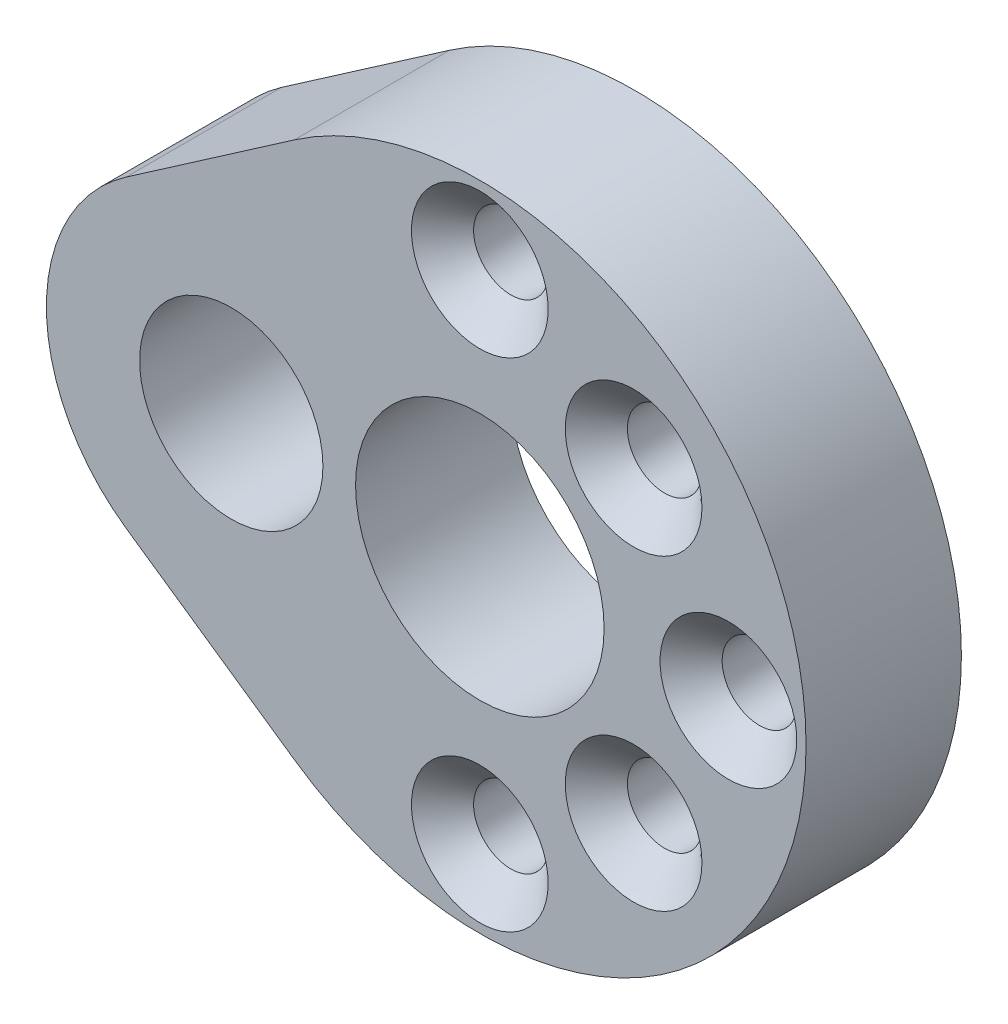
ISO-10303-21;
HEADER;
FILE_DESCRIPTION(('STEP AP214'),'2;1');
FILE_NAME('part.step','',(''),(''),'','','');
FILE_SCHEMA(('AUTOMOTIVE_DESIGN { 1 0 10303 214 1 1 1 1 }'));
ENDSEC;
DATA;
#1=APPLICATION_CONTEXT('core data for automotive mechanical design processes');
#2=APPLICATION_PROTOCOL_DEFINITION('international standard','automotive_design',2000,#1);
#3=PRODUCT_CONTEXT('',#1,'mechanical');
#4=PRODUCT('Part','Part','',(#3));
#5=PRODUCT_RELATED_PRODUCT_CATEGORY('part','',(#4));
#6=PRODUCT_DEFINITION_FORMATION('','',#4);
#7=PRODUCT_DEFINITION_CONTEXT('part definition',#1,'design');
#8=PRODUCT_DEFINITION('design','',#6,#7);
#9=PRODUCT_DEFINITION_SHAPE('','',#8);
#10=(LENGTH_UNIT() NAMED_UNIT(*) SI_UNIT(.MILLI.,.METRE.));
#11=(NAMED_UNIT(*) PLANE_ANGLE_UNIT() SI_UNIT($,.RADIAN.));
#12=(NAMED_UNIT(*) SI_UNIT($,.STERADIAN.) SOLID_ANGLE_UNIT());
#13=UNCERTAINTY_MEASURE_WITH_UNIT(LENGTH_MEASURE(1.E-05),#10,'distance_accuracy_value','');
#14=(GEOMETRIC_REPRESENTATION_CONTEXT(3) GLOBAL_UNCERTAINTY_ASSIGNED_CONTEXT((#13)) GLOBAL_UNIT_ASSIGNED_CONTEXT((#10,
#11,#12)) REPRESENTATION_CONTEXT('',''));
#15=CARTESIAN_POINT('',(0.,0.,0.));
#16=DIRECTION('',(0.,0.,1.));
#17=DIRECTION('',(1.,0.,0.));
#18=AXIS2_PLACEMENT_3D('',#15,#16,#17);
#19=CARTESIAN_POINT('',(-8.,0.,-16.8291413922398));
#20=DIRECTION('',(0.,0.,1.));
#21=DIRECTION('',(1.,0.,0.));
#22=AXIS2_PLACEMENT_3D('',#19,#20,#21);
#23=CYLINDRICAL_SURFACE('',#22,5.95);
#24=CARTESIAN_POINT('',(-8.,0.,0.));
#25=DIRECTION('',(0.,0.,1.));
#26=DIRECTION('',(1.,0.,0.));
#27=AXIS2_PLACEMENT_3D('',#24,#25,#26);
#28=CIRCLE('',#27,5.95);
#29=CARTESIAN_POINT('',(-11.3840625,-4.89393716715834,0.));
#30=VERTEX_POINT('',#29);
#31=CARTESIAN_POINT('',(-11.3840625,4.89393716715834,0.));
#32=VERTEX_POINT('',#31);
#33=EDGE_CURVE('E52',#30,#32,#28,.F.);
#34=ORIENTED_EDGE('',*,*,#33,.F.);
#35=DIRECTION('',(0.,0.,1.));
#36=VECTOR('',#35,1.);
#37=CARTESIAN_POINT('',(-11.3840625,-4.89393716715834,-6.99657353912253));
#38=LINE('',#37,#36);
#39=CARTESIAN_POINT('',(-11.3840625,-4.89393716715834,5.));
#40=VERTEX_POINT('',#39);
#41=EDGE_CURVE('E47',#30,#40,#38,.T.);
#42=ORIENTED_EDGE('',*,*,#41,.T.);
#43=CARTESIAN_POINT('',(-8.,0.,5.));
#44=DIRECTION('',(0.,0.,1.));
#45=DIRECTION('',(1.,0.,0.));
#46=AXIS2_PLACEMENT_3D('',#43,#44,#45);
#47=CIRCLE('',#46,5.95);
#48=CARTESIAN_POINT('',(-11.3840625,4.89393716715834,5.));
#49=VERTEX_POINT('',#48);
#50=EDGE_CURVE('E155',#49,#40,#47,.T.);
#51=ORIENTED_EDGE('',*,*,#50,.F.);
#52=DIRECTION('',(0.,0.,1.));
#53=VECTOR('',#52,1.);
#54=CARTESIAN_POINT('',(-11.3840625,4.89393716715834,-6.99657353912253));
#55=LINE('',#54,#53);
#56=EDGE_CURVE('E96',#32,#49,#55,.T.);
#57=ORIENTED_EDGE('',*,*,#56,.F.);
#58=EDGE_LOOP('',(#34,#42,#51,#57));
#59=FACE_BOUND('',#58,.T.);
#60=ADVANCED_FACE('F32',(#59),#23,.T.);
#61=CARTESIAN_POINT('',(0.,0.,5.));
#62=DIRECTION('',(0.,0.,-1.));
#63=DIRECTION('',(-1.,0.,0.));
#64=AXIS2_PLACEMENT_3D('',#61,#62,#63);
#65=CYLINDRICAL_SURFACE('',#64,10.5);
#66=DIRECTION('',(0.,0.,1.));
#67=VECTOR('',#66,1.);
#68=CARTESIAN_POINT('',(-5.971875,-8.63635970675,-6.99657353912253));
#69=LINE('',#68,#67);
#70=CARTESIAN_POINT('',(-5.971875,-8.63635970675,0.));
#71=VERTEX_POINT('',#70);
#72=CARTESIAN_POINT('',(-5.971875,-8.63635970675,5.));
#73=VERTEX_POINT('',#72);
#74=EDGE_CURVE('E82',#71,#73,#69,.T.);
#75=ORIENTED_EDGE('',*,*,#74,.F.);
#76=CARTESIAN_POINT('',(0.,0.,0.));
#77=DIRECTION('',(0.,0.,1.));
#78=DIRECTION('',(1.,0.,0.));
#79=AXIS2_PLACEMENT_3D('',#76,#77,#78);
#80=CIRCLE('',#79,10.5);
#81=CARTESIAN_POINT('',(-5.971875,8.63635970675,0.));
#82=VERTEX_POINT('',#81);
#83=EDGE_CURVE('E36',#71,#82,#80,.T.);
#84=ORIENTED_EDGE('',*,*,#83,.T.);
#85=DIRECTION('',(0.,0.,1.));
#86=VECTOR('',#85,1.);
#87=CARTESIAN_POINT('',(-5.971875,8.63635970675,-6.99657353912253));
#88=LINE('',#87,#86);
#89=CARTESIAN_POINT('',(-5.971875,8.63635970675,5.));
#90=VERTEX_POINT('',#89);
#91=EDGE_CURVE('E91',#82,#90,#88,.T.);
#92=ORIENTED_EDGE('',*,*,#91,.T.);
#93=CARTESIAN_POINT('',(0.,0.,5.));
#94=DIRECTION('',(0.,0.,1.));
#95=DIRECTION('',(1.,0.,0.));
#96=AXIS2_PLACEMENT_3D('',#93,#94,#95);
#97=CIRCLE('',#96,10.5);
#98=EDGE_CURVE('E11',#73,#90,#97,.T.);
#99=ORIENTED_EDGE('',*,*,#98,.F.);
#100=EDGE_LOOP('',(#75,#84,#92,#99));
#101=FACE_BOUND('',#100,.T.);
#102=ADVANCED_FACE('F34',(#101),#65,.T.);
#103=CARTESIAN_POINT('',(0.,0.,5.));
#104=DIRECTION('',(0.,0.,1.));
#105=DIRECTION('',(1.,0.,0.));
#106=AXIS2_PLACEMENT_3D('',#103,#104,#105);
#107=PLANE('',#106);
#108=ORIENTED_EDGE('',*,*,#50,.T.);
#109=DIRECTION('',(-0.822510448261905,0.56875,0.));
#110=VECTOR('',#109,1.);
#111=CARTESIAN_POINT('',(-11.3840625,-4.89393716715834,5.));
#112=LINE('',#111,#110);
#113=EDGE_CURVE('E380',#73,#40,#112,.T.);
#114=ORIENTED_EDGE('',*,*,#113,.F.);
#115=ORIENTED_EDGE('',*,*,#98,.T.);
#116=DIRECTION('',(-0.822510448261905,-0.56875,0.));
#117=VECTOR('',#116,1.);
#118=CARTESIAN_POINT('',(-11.3840625,4.89393716715834,5.));
#119=LINE('',#118,#117);
#120=EDGE_CURVE('E88',#90,#49,#119,.T.);
#121=ORIENTED_EDGE('',*,*,#120,.T.);
#122=EDGE_LOOP('',(#108,#114,#115,#121));
#123=FACE_BOUND('',#122,.T.);
#124=CARTESIAN_POINT('',(4.94974746830583,-4.94974746830583,5.));
#125=DIRECTION('',(0.,0.,1.));
#126=DIRECTION('',(1.,0.,0.));
#127=AXIS2_PLACEMENT_3D('',#124,#125,#126);
#128=CIRCLE('',#127,2.2);
#129=CARTESIAN_POINT('',(7.14974746830583,-4.94974746830583,5.));
#130=VERTEX_POINT('',#129);
#131=EDGE_CURVE('E141',#130,#130,#128,.T.);
#132=ORIENTED_EDGE('',*,*,#131,.F.);
#133=EDGE_LOOP('',(#132));
#134=FACE_BOUND('',#133,.T.);
#135=CARTESIAN_POINT('',(8.,0.,5.));
#136=DIRECTION('',(0.,0.,1.));
#137=DIRECTION('',(1.,0.,0.));
#138=AXIS2_PLACEMENT_3D('',#135,#136,#137);
#139=CIRCLE('',#138,2.2);
#140=CARTESIAN_POINT('',(10.2,0.,5.));
#141=VERTEX_POINT('',#140);
#142=EDGE_CURVE('E132',#141,#141,#139,.T.);
#143=ORIENTED_EDGE('',*,*,#142,.F.);
#144=EDGE_LOOP('',(#143));
#145=FACE_BOUND('',#144,.T.);
#146=CARTESIAN_POINT('',(0.,-8.,5.));
#147=DIRECTION('',(0.,0.,1.));
#148=DIRECTION('',(1.,0.,0.));
#149=AXIS2_PLACEMENT_3D('',#146,#147,#148);
#150=CIRCLE('',#149,2.2);
#151=CARTESIAN_POINT('',(2.20000000000008,-8.,5.));
#152=VERTEX_POINT('',#151);
#153=EDGE_CURVE('E123',#152,#152,#150,.T.);
#154=ORIENTED_EDGE('',*,*,#153,.F.);
#155=EDGE_LOOP('',(#154));
#156=FACE_BOUND('',#155,.T.);
#157=CARTESIAN_POINT('',(0.,8.,5.));
#158=DIRECTION('',(0.,0.,1.));
#159=DIRECTION('',(1.,0.,0.));
#160=AXIS2_PLACEMENT_3D('',#157,#158,#159);
#161=CIRCLE('',#160,2.2);
#162=CARTESIAN_POINT('',(2.19999999999997,8.,5.));
#163=VERTEX_POINT('',#162);
#164=EDGE_CURVE('E114',#163,#163,#161,.T.);
#165=ORIENTED_EDGE('',*,*,#164,.F.);
#166=EDGE_LOOP('',(#165));
#167=FACE_BOUND('',#166,.T.);
#168=CARTESIAN_POINT('',(4.94974746830581,4.94974746830585,5.));
#169=DIRECTION('',(0.,0.,1.));
#170=DIRECTION('',(1.,0.,0.));
#171=AXIS2_PLACEMENT_3D('',#168,#169,#170);
#172=CIRCLE('',#171,2.2);
#173=CARTESIAN_POINT('',(7.14974746830582,4.94974746830585,5.));
#174=VERTEX_POINT('',#173);
#175=EDGE_CURVE('E103',#174,#174,#172,.T.);
#176=ORIENTED_EDGE('',*,*,#175,.F.);
#177=EDGE_LOOP('',(#176));
#178=FACE_BOUND('',#177,.T.);
#179=CARTESIAN_POINT('',(-8.,0.,5.));
#180=DIRECTION('',(0.,0.,1.));
#181=DIRECTION('',(1.,0.,0.));
#182=AXIS2_PLACEMENT_3D('',#179,#180,#181);
#183=CIRCLE('',#182,2.95);
#184=CARTESIAN_POINT('',(-5.05,0.,5.));
#185=VERTEX_POINT('',#184);
#186=EDGE_CURVE('E150',#185,#185,#183,.T.);
#187=ORIENTED_EDGE('',*,*,#186,.F.);
#188=EDGE_LOOP('',(#187));
#189=FACE_BOUND('',#188,.T.);
#190=CARTESIAN_POINT('',(0.,0.,5.));
#191=DIRECTION('',(0.,0.,1.));
#192=DIRECTION('',(1.,0.,0.));
#193=AXIS2_PLACEMENT_3D('',#190,#191,#192);
#194=CIRCLE('',#193,4.);
#195=CARTESIAN_POINT('',(4.,0.,5.));
#196=VERTEX_POINT('',#195);
#197=EDGE_CURVE('E95',#196,#196,#194,.T.);
#198=ORIENTED_EDGE('',*,*,#197,.F.);
#199=EDGE_LOOP('',(#198));
#200=FACE_BOUND('',#199,.T.);
#201=ADVANCED_FACE('F163',(#123,#134,#145,#156,#167,#178,#189,#200),#107,.T.);
#202=CARTESIAN_POINT('',(0.,0.,0.));
#203=DIRECTION('',(0.,0.,1.));
#204=DIRECTION('',(1.,0.,0.));
#205=AXIS2_PLACEMENT_3D('',#202,#203,#204);
#206=PLANE('',#205);
#207=DIRECTION('',(0.822510448261905,-0.56875,0.));
#208=VECTOR('',#207,1.);
#209=CARTESIAN_POINT('',(-11.3840625,-4.89393716715834,0.));
#210=LINE('',#209,#208);
#211=EDGE_CURVE('E75',#30,#71,#210,.T.);
#212=ORIENTED_EDGE('',*,*,#211,.F.);
#213=ORIENTED_EDGE('',*,*,#33,.T.);
#214=DIRECTION('',(0.822510448261905,0.56875,0.));
#215=VECTOR('',#214,1.);
#216=CARTESIAN_POINT('',(-11.3840625,4.89393716715834,0.));
#217=LINE('',#216,#215);
#218=EDGE_CURVE('E77',#32,#82,#217,.T.);
#219=ORIENTED_EDGE('',*,*,#218,.T.);
#220=ORIENTED_EDGE('',*,*,#83,.F.);
#221=EDGE_LOOP('',(#212,#213,#219,#220));
#222=FACE_BOUND('',#221,.T.);
#223=CARTESIAN_POINT('',(-8.,0.,0.));
#224=DIRECTION('',(0.,0.,1.));
#225=DIRECTION('',(1.,0.,0.));
#226=AXIS2_PLACEMENT_3D('',#223,#224,#225);
#227=CIRCLE('',#226,2.95);
#228=CARTESIAN_POINT('',(-5.05,0.,0.));
#229=VERTEX_POINT('',#228);
#230=EDGE_CURVE('E152',#229,#229,#227,.F.);
#231=ORIENTED_EDGE('',*,*,#230,.F.);
#232=EDGE_LOOP('',(#231));
#233=FACE_BOUND('',#232,.T.);
#234=CARTESIAN_POINT('',(4.94974746830583,-4.94974746830583,0.));
#235=DIRECTION('',(0.,0.,1.));
#236=DIRECTION('',(1.,0.,0.));
#237=AXIS2_PLACEMENT_3D('',#234,#235,#236);
#238=CIRCLE('',#237,1.2);
#239=CARTESIAN_POINT('',(6.14974746830583,-4.94974746830583,0.));
#240=VERTEX_POINT('',#239);
#241=EDGE_CURVE('E147',#240,#240,#238,.T.);
#242=ORIENTED_EDGE('',*,*,#241,.T.);
#243=EDGE_LOOP('',(#242));
#244=FACE_BOUND('',#243,.T.);
#245=CARTESIAN_POINT('',(8.,0.,0.));
#246=DIRECTION('',(0.,0.,1.));
#247=DIRECTION('',(1.,0.,0.));
#248=AXIS2_PLACEMENT_3D('',#245,#246,#247);
#249=CIRCLE('',#248,1.2);
#250=CARTESIAN_POINT('',(9.2,0.,0.));
#251=VERTEX_POINT('',#250);
#252=EDGE_CURVE('E138',#251,#251,#249,.T.);
#253=ORIENTED_EDGE('',*,*,#252,.T.);
#254=EDGE_LOOP('',(#253));
#255=FACE_BOUND('',#254,.T.);
#256=CARTESIAN_POINT('',(0.,-8.,0.));
#257=DIRECTION('',(0.,0.,1.));
#258=DIRECTION('',(1.,0.,0.));
#259=AXIS2_PLACEMENT_3D('',#256,#257,#258);
#260=CIRCLE('',#259,1.2);
#261=CARTESIAN_POINT('',(1.20000000000008,-8.,0.));
#262=VERTEX_POINT('',#261);
#263=EDGE_CURVE('E129',#262,#262,#260,.T.);
#264=ORIENTED_EDGE('',*,*,#263,.T.);
#265=EDGE_LOOP('',(#264));
#266=FACE_BOUND('',#265,.T.);
#267=CARTESIAN_POINT('',(0.,8.,0.));
#268=DIRECTION('',(0.,0.,1.));
#269=DIRECTION('',(1.,0.,0.));
#270=AXIS2_PLACEMENT_3D('',#267,#268,#269);
#271=CIRCLE('',#270,1.2);
#272=CARTESIAN_POINT('',(1.19999999999997,8.,0.));
#273=VERTEX_POINT('',#272);
#274=EDGE_CURVE('E120',#273,#273,#271,.T.);
#275=ORIENTED_EDGE('',*,*,#274,.T.);
#276=EDGE_LOOP('',(#275));
#277=FACE_BOUND('',#276,.T.);
#278=CARTESIAN_POINT('',(4.94974746830581,4.94974746830585,0.));
#279=DIRECTION('',(0.,0.,1.));
#280=DIRECTION('',(1.,0.,0.));
#281=AXIS2_PLACEMENT_3D('',#278,#279,#280);
#282=CIRCLE('',#281,1.2);
#283=CARTESIAN_POINT('',(6.14974746830581,4.94974746830585,0.));
#284=VERTEX_POINT('',#283);
#285=EDGE_CURVE('E111',#284,#284,#282,.T.);
#286=ORIENTED_EDGE('',*,*,#285,.T.);
#287=EDGE_LOOP('',(#286));
#288=FACE_BOUND('',#287,.T.);
#289=CARTESIAN_POINT('',(0.,0.,0.));
#290=DIRECTION('',(0.,0.,1.));
#291=DIRECTION('',(1.,0.,0.));
#292=AXIS2_PLACEMENT_3D('',#289,#290,#291);
#293=CIRCLE('',#292,4.);
#294=CARTESIAN_POINT('',(4.,0.,0.));
#295=VERTEX_POINT('',#294);
#296=EDGE_CURVE('E100',#295,#295,#293,.T.);
#297=ORIENTED_EDGE('',*,*,#296,.T.);
#298=EDGE_LOOP('',(#297));
#299=FACE_BOUND('',#298,.T.);
#300=ADVANCED_FACE('F72',(#222,#233,#244,#255,#266,#277,#288,#299),#206,.F.);
#301=CARTESIAN_POINT('',(-8.,0.,-16.8291413922398));
#302=DIRECTION('',(0.,0.,1.));
#303=DIRECTION('',(1.,0.,0.));
#304=AXIS2_PLACEMENT_3D('',#301,#302,#303);
#305=CYLINDRICAL_SURFACE('',#304,2.95);
#306=ORIENTED_EDGE('',*,*,#186,.T.);
#307=EDGE_LOOP('',(#306));
#308=FACE_BOUND('',#307,.T.);
#309=ORIENTED_EDGE('',*,*,#230,.T.);
#310=EDGE_LOOP('',(#309));
#311=FACE_BOUND('',#310,.T.);
#312=ADVANCED_FACE('F160',(#308,#311),#305,.F.);
#313=CARTESIAN_POINT('',(4.94974746830583,-4.94974746830583,5.));
#314=DIRECTION('',(0.,0.,1.));
#315=DIRECTION('',(1.,0.,0.));
#316=AXIS2_PLACEMENT_3D('',#313,#314,#315);
#317=CYLINDRICAL_SURFACE('',#316,1.2);
#318=ORIENTED_EDGE('',*,*,#241,.F.);
#319=EDGE_LOOP('',(#318));
#320=FACE_BOUND('',#319,.T.);
#321=CARTESIAN_POINT('',(4.94974746830583,-4.94974746830583,4.));
#322=DIRECTION('',(0.,0.,1.));
#323=DIRECTION('',(1.,0.,0.));
#324=AXIS2_PLACEMENT_3D('',#321,#322,#323);
#325=CIRCLE('',#324,1.2);
#326=CARTESIAN_POINT('',(6.14974746830583,-4.94974746830583,4.));
#327=VERTEX_POINT('',#326);
#328=EDGE_CURVE('E144',#327,#327,#325,.T.);
#329=ORIENTED_EDGE('',*,*,#328,.T.);
#330=EDGE_LOOP('',(#329));
#331=FACE_BOUND('',#330,.T.);
#332=ADVANCED_FACE('F198',(#320,#331),#317,.F.);
#333=CARTESIAN_POINT('',(4.94974746830583,-4.94974746830583,5.));
#334=DIRECTION('',(0.,0.,1.));
#335=DIRECTION('',(1.,0.,0.));
#336=AXIS2_PLACEMENT_3D('',#333,#334,#335);
#337=CONICAL_SURFACE('',#336,2.2,0.785398163397447);
#338=ORIENTED_EDGE('',*,*,#328,.F.);
#339=EDGE_LOOP('',(#338));
#340=FACE_BOUND('',#339,.T.);
#341=ORIENTED_EDGE('',*,*,#131,.T.);
#342=EDGE_LOOP('',(#341));
#343=FACE_BOUND('',#342,.T.);
#344=ADVANCED_FACE('F202',(#340,#343),#337,.F.);
#345=CARTESIAN_POINT('',(8.,0.,5.));
#346=DIRECTION('',(0.,0.,1.));
#347=DIRECTION('',(1.,0.,0.));
#348=AXIS2_PLACEMENT_3D('',#345,#346,#347);
#349=CYLINDRICAL_SURFACE('',#348,1.2);
#350=ORIENTED_EDGE('',*,*,#252,.F.);
#351=EDGE_LOOP('',(#350));
#352=FACE_BOUND('',#351,.T.);
#353=CARTESIAN_POINT('',(8.,0.,4.));
#354=DIRECTION('',(0.,0.,1.));
#355=DIRECTION('',(1.,0.,0.));
#356=AXIS2_PLACEMENT_3D('',#353,#354,#355);
#357=CIRCLE('',#356,1.2);
#358=CARTESIAN_POINT('',(9.2,0.,4.));
#359=VERTEX_POINT('',#358);
#360=EDGE_CURVE('E135',#359,#359,#357,.T.);
#361=ORIENTED_EDGE('',*,*,#360,.T.);
#362=EDGE_LOOP('',(#361));
#363=FACE_BOUND('',#362,.T.);
#364=ADVANCED_FACE('F206',(#352,#363),#349,.F.);
#365=CARTESIAN_POINT('',(8.,0.,5.));
#366=DIRECTION('',(0.,0.,1.));
#367=DIRECTION('',(1.,0.,0.));
#368=AXIS2_PLACEMENT_3D('',#365,#366,#367);
#369=CONICAL_SURFACE('',#368,2.2,0.785398163397447);
#370=ORIENTED_EDGE('',*,*,#360,.F.);
#371=EDGE_LOOP('',(#370));
#372=FACE_BOUND('',#371,.T.);
#373=ORIENTED_EDGE('',*,*,#142,.T.);
#374=EDGE_LOOP('',(#373));
#375=FACE_BOUND('',#374,.T.);
#376=ADVANCED_FACE('F210',(#372,#375),#369,.F.);
#377=CARTESIAN_POINT('',(0.,-8.,5.));
#378=DIRECTION('',(0.,0.,1.));
#379=DIRECTION('',(1.,0.,0.));
#380=AXIS2_PLACEMENT_3D('',#377,#378,#379);
#381=CYLINDRICAL_SURFACE('',#380,1.2);
#382=ORIENTED_EDGE('',*,*,#263,.F.);
#383=EDGE_LOOP('',(#382));
#384=FACE_BOUND('',#383,.T.);
#385=CARTESIAN_POINT('',(0.,-8.,4.));
#386=DIRECTION('',(0.,0.,1.));
#387=DIRECTION('',(1.,0.,0.));
#388=AXIS2_PLACEMENT_3D('',#385,#386,#387);
#389=CIRCLE('',#388,1.2);
#390=CARTESIAN_POINT('',(1.20000000000008,-8.,4.));
#391=VERTEX_POINT('',#390);
#392=EDGE_CURVE('E126',#391,#391,#389,.T.);
#393=ORIENTED_EDGE('',*,*,#392,.T.);
#394=EDGE_LOOP('',(#393));
#395=FACE_BOUND('',#394,.T.);
#396=ADVANCED_FACE('F214',(#384,#395),#381,.F.);
#397=CARTESIAN_POINT('',(0.,-8.,5.));
#398=DIRECTION('',(0.,0.,1.));
#399=DIRECTION('',(1.,0.,0.));
#400=AXIS2_PLACEMENT_3D('',#397,#398,#399);
#401=CONICAL_SURFACE('',#400,2.2,0.785398163397447);
#402=ORIENTED_EDGE('',*,*,#392,.F.);
#403=EDGE_LOOP('',(#402));
#404=FACE_BOUND('',#403,.T.);
#405=ORIENTED_EDGE('',*,*,#153,.T.);
#406=EDGE_LOOP('',(#405));
#407=FACE_BOUND('',#406,.T.);
#408=ADVANCED_FACE('F218',(#404,#407),#401,.F.);
#409=CARTESIAN_POINT('',(0.,8.,5.));
#410=DIRECTION('',(0.,0.,1.));
#411=DIRECTION('',(1.,0.,0.));
#412=AXIS2_PLACEMENT_3D('',#409,#410,#411);
#413=CYLINDRICAL_SURFACE('',#412,1.2);
#414=ORIENTED_EDGE('',*,*,#274,.F.);
#415=EDGE_LOOP('',(#414));
#416=FACE_BOUND('',#415,.T.);
#417=CARTESIAN_POINT('',(0.,8.,4.));
#418=DIRECTION('',(0.,0.,1.));
#419=DIRECTION('',(1.,0.,0.));
#420=AXIS2_PLACEMENT_3D('',#417,#418,#419);
#421=CIRCLE('',#420,1.2);
#422=CARTESIAN_POINT('',(1.19999999999997,8.,4.));
#423=VERTEX_POINT('',#422);
#424=EDGE_CURVE('E117',#423,#423,#421,.T.);
#425=ORIENTED_EDGE('',*,*,#424,.T.);
#426=EDGE_LOOP('',(#425));
#427=FACE_BOUND('',#426,.T.);
#428=ADVANCED_FACE('F222',(#416,#427),#413,.F.);
#429=CARTESIAN_POINT('',(0.,8.,5.));
#430=DIRECTION('',(0.,0.,1.));
#431=DIRECTION('',(1.,0.,0.));
#432=AXIS2_PLACEMENT_3D('',#429,#430,#431);
#433=CONICAL_SURFACE('',#432,2.2,0.785398163397447);
#434=ORIENTED_EDGE('',*,*,#424,.F.);
#435=EDGE_LOOP('',(#434));
#436=FACE_BOUND('',#435,.T.);
#437=ORIENTED_EDGE('',*,*,#164,.T.);
#438=EDGE_LOOP('',(#437));
#439=FACE_BOUND('',#438,.T.);
#440=ADVANCED_FACE('F226',(#436,#439),#433,.F.);
#441=CARTESIAN_POINT('',(4.94974746830581,4.94974746830585,5.));
#442=DIRECTION('',(0.,0.,1.));
#443=DIRECTION('',(1.,0.,0.));
#444=AXIS2_PLACEMENT_3D('',#441,#442,#443);
#445=CYLINDRICAL_SURFACE('',#444,1.2);
#446=ORIENTED_EDGE('',*,*,#285,.F.);
#447=EDGE_LOOP('',(#446));
#448=FACE_BOUND('',#447,.T.);
#449=CARTESIAN_POINT('',(4.94974746830581,4.94974746830585,4.));
#450=DIRECTION('',(0.,0.,1.));
#451=DIRECTION('',(1.,0.,0.));
#452=AXIS2_PLACEMENT_3D('',#449,#450,#451);
#453=CIRCLE('',#452,1.2);
#454=CARTESIAN_POINT('',(6.14974746830581,4.94974746830585,4.));
#455=VERTEX_POINT('',#454);
#456=EDGE_CURVE('E108',#455,#455,#453,.T.);
#457=ORIENTED_EDGE('',*,*,#456,.T.);
#458=EDGE_LOOP('',(#457));
#459=FACE_BOUND('',#458,.T.);
#460=ADVANCED_FACE('F230',(#448,#459),#445,.F.);
#461=CARTESIAN_POINT('',(4.94974746830581,4.94974746830585,5.));
#462=DIRECTION('',(0.,0.,1.));
#463=DIRECTION('',(1.,0.,0.));
#464=AXIS2_PLACEMENT_3D('',#461,#462,#463);
#465=CONICAL_SURFACE('',#464,2.2,0.785398163397447);
#466=ORIENTED_EDGE('',*,*,#456,.F.);
#467=EDGE_LOOP('',(#466));
#468=FACE_BOUND('',#467,.T.);
#469=ORIENTED_EDGE('',*,*,#175,.T.);
#470=EDGE_LOOP('',(#469));
#471=FACE_BOUND('',#470,.T.);
#472=ADVANCED_FACE('F180',(#468,#471),#465,.F.);
#473=CARTESIAN_POINT('',(0.,0.,0.));
#474=DIRECTION('',(0.,0.,1.));
#475=DIRECTION('',(1.,0.,0.));
#476=AXIS2_PLACEMENT_3D('',#473,#474,#475);
#477=CYLINDRICAL_SURFACE('',#476,4.);
#478=ORIENTED_EDGE('',*,*,#296,.F.);
#479=EDGE_LOOP('',(#478));
#480=FACE_BOUND('',#479,.T.);
#481=ORIENTED_EDGE('',*,*,#197,.T.);
#482=EDGE_LOOP('',(#481));
#483=FACE_BOUND('',#482,.T.);
#484=ADVANCED_FACE('F176',(#480,#483),#477,.F.);
#485=CARTESIAN_POINT('',(-11.3840625,4.89393716715834,-6.99657353912253));
#486=DIRECTION('',(-0.56875,0.822510448261905,0.));
#487=DIRECTION('',(-0.822510448261905,-0.56875,0.));
#488=AXIS2_PLACEMENT_3D('',#485,#486,#487);
#489=PLANE('',#488);
#490=ORIENTED_EDGE('',*,*,#218,.F.);
#491=ORIENTED_EDGE('',*,*,#56,.T.);
#492=ORIENTED_EDGE('',*,*,#120,.F.);
#493=ORIENTED_EDGE('',*,*,#91,.F.);
#494=EDGE_LOOP('',(#490,#491,#492,#493));
#495=FACE_BOUND('',#494,.T.);
#496=ADVANCED_FACE('F179',(#495),#489,.T.);
#497=CARTESIAN_POINT('',(-11.3840625,-4.89393716715834,-6.99657353912253));
#498=DIRECTION('',(0.56875,0.822510448261905,0.));
#499=DIRECTION('',(-0.822510448261905,0.56875,0.));
#500=AXIS2_PLACEMENT_3D('',#497,#498,#499);
#501=PLANE('',#500);
#502=ORIENTED_EDGE('',*,*,#41,.F.);
#503=ORIENTED_EDGE('',*,*,#211,.T.);
#504=ORIENTED_EDGE('',*,*,#74,.T.);
#505=ORIENTED_EDGE('',*,*,#113,.T.);
#506=EDGE_LOOP('',(#502,#503,#504,#505));
#507=FACE_BOUND('',#506,.T.);
#508=ADVANCED_FACE('F87',(#507),#501,.F.);
#509=CLOSED_SHELL('',(#60,#102,#201,#300,#312,#332,#344,#364,#376,#396,#408,#428,#440,#460,#472,
#484,#496,#508));
#510=MANIFOLD_SOLID_BREP('B2',#509);
#511=ADVANCED_BREP_SHAPE_REPRESENTATION('',(#18,#510),#14);
#512=SHAPE_DEFINITION_REPRESENTATION(#9,#511);
ENDSEC;
END-ISO-10303-21;
